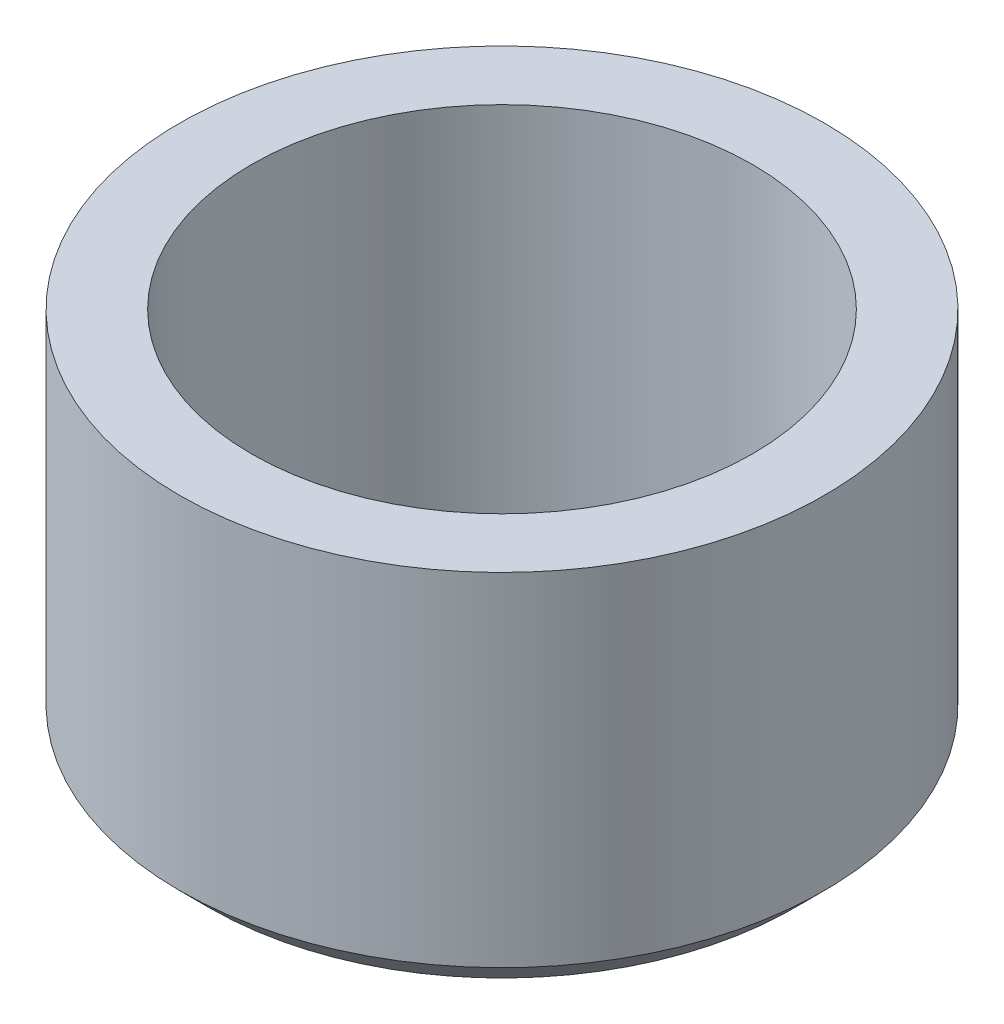
ISO-10303-21;
HEADER;
FILE_DESCRIPTION(('STEP AP214'),'2;1');
FILE_NAME('part.step','',(''),(''),'','','');
FILE_SCHEMA(('AUTOMOTIVE_DESIGN { 1 0 10303 214 1 1 1 1 }'));
ENDSEC;
DATA;
#1=APPLICATION_CONTEXT('core data for automotive mechanical design processes');
#2=APPLICATION_PROTOCOL_DEFINITION('international standard','automotive_design',2000,#1);
#3=PRODUCT_CONTEXT('',#1,'mechanical');
#4=PRODUCT('Part','Part','',(#3));
#5=PRODUCT_RELATED_PRODUCT_CATEGORY('part','',(#4));
#6=PRODUCT_DEFINITION_FORMATION('','',#4);
#7=PRODUCT_DEFINITION_CONTEXT('part definition',#1,'design');
#8=PRODUCT_DEFINITION('design','',#6,#7);
#9=PRODUCT_DEFINITION_SHAPE('','',#8);
#10=(LENGTH_UNIT() NAMED_UNIT(*) SI_UNIT(.MILLI.,.METRE.));
#11=(NAMED_UNIT(*) PLANE_ANGLE_UNIT() SI_UNIT($,.RADIAN.));
#12=(NAMED_UNIT(*) SI_UNIT($,.STERADIAN.) SOLID_ANGLE_UNIT());
#13=UNCERTAINTY_MEASURE_WITH_UNIT(LENGTH_MEASURE(1.E-05),#10,'distance_accuracy_value','');
#14=(GEOMETRIC_REPRESENTATION_CONTEXT(3) GLOBAL_UNCERTAINTY_ASSIGNED_CONTEXT((#13)) GLOBAL_UNIT_ASSIGNED_CONTEXT((#10,
#11,#12)) REPRESENTATION_CONTEXT('',''));
#15=CARTESIAN_POINT('',(0.,0.,0.));
#16=DIRECTION('',(0.,0.,1.));
#17=DIRECTION('',(1.,0.,0.));
#18=AXIS2_PLACEMENT_3D('',#15,#16,#17);
#19=CARTESIAN_POINT('',(-5.275,6.1,0.));
#20=DIRECTION('',(0.,1.,0.));
#21=DIRECTION('',(0.,0.,1.));
#22=AXIS2_PLACEMENT_3D('',#19,#20,#21);
#23=PLANE('',#22);
#24=CARTESIAN_POINT('',(0.,6.1,0.));
#25=DIRECTION('',(0.,1.,0.));
#26=DIRECTION('',(0.,0.,1.));
#27=AXIS2_PLACEMENT_3D('',#24,#25,#26);
#28=CIRCLE('',#27,5.275);
#29=CARTESIAN_POINT('',(0.,6.1,5.275));
#30=VERTEX_POINT('',#29);
#31=EDGE_CURVE('E55',#30,#30,#28,.T.);
#32=ORIENTED_EDGE('',*,*,#31,.T.);
#33=EDGE_LOOP('',(#32));
#34=FACE_BOUND('',#33,.T.);
#35=CARTESIAN_POINT('',(0.,6.1,0.));
#36=DIRECTION('',(0.,1.,0.));
#37=DIRECTION('',(0.,0.,1.));
#38=AXIS2_PLACEMENT_3D('',#35,#36,#37);
#39=CIRCLE('',#38,4.1);
#40=CARTESIAN_POINT('',(0.,6.1,4.1));
#41=VERTEX_POINT('',#40);
#42=EDGE_CURVE('E66',#41,#41,#39,.T.);
#43=ORIENTED_EDGE('',*,*,#42,.F.);
#44=EDGE_LOOP('',(#43));
#45=FACE_BOUND('',#44,.T.);
#46=ADVANCED_FACE('F41',(#34,#45),#23,.T.);
#47=CARTESIAN_POINT('',(0.,36.0573770491804,0.));
#48=DIRECTION('',(0.,1.,0.));
#49=DIRECTION('',(0.,0.,1.));
#50=AXIS2_PLACEMENT_3D('',#47,#48,#49);
#51=CYLINDRICAL_SURFACE('',#50,5.275);
#52=CARTESIAN_POINT('',(0.,0.5,0.));
#53=DIRECTION('',(0.,-1.,0.));
#54=DIRECTION('',(0.,0.,-1.));
#55=AXIS2_PLACEMENT_3D('',#52,#53,#54);
#56=CIRCLE('',#55,5.275);
#57=CARTESIAN_POINT('',(0.,0.5,-5.275));
#58=VERTEX_POINT('',#57);
#59=EDGE_CURVE('E49',#58,#58,#56,.F.);
#60=ORIENTED_EDGE('',*,*,#59,.T.);
#61=EDGE_LOOP('',(#60));
#62=FACE_BOUND('',#61,.T.);
#63=ORIENTED_EDGE('',*,*,#31,.F.);
#64=EDGE_LOOP('',(#63));
#65=FACE_BOUND('',#64,.T.);
#66=ADVANCED_FACE('F74',(#62,#65),#51,.T.);
#67=CARTESIAN_POINT('',(-5.275,0.,0.));
#68=DIRECTION('',(0.,-1.,0.));
#69=DIRECTION('',(0.,0.,-1.));
#70=AXIS2_PLACEMENT_3D('',#67,#68,#69);
#71=PLANE('',#70);
#72=CARTESIAN_POINT('',(0.,0.,0.));
#73=DIRECTION('',(0.,-1.,0.));
#74=DIRECTION('',(0.,0.,-1.));
#75=AXIS2_PLACEMENT_3D('',#72,#73,#74);
#76=CIRCLE('',#75,4.775);
#77=CARTESIAN_POINT('',(0.,0.,-4.775));
#78=VERTEX_POINT('',#77);
#79=EDGE_CURVE('E10',#78,#78,#76,.T.);
#80=ORIENTED_EDGE('',*,*,#79,.T.);
#81=EDGE_LOOP('',(#80));
#82=FACE_BOUND('',#81,.T.);
#83=CARTESIAN_POINT('',(0.,0.,0.));
#84=DIRECTION('',(0.,1.,0.));
#85=DIRECTION('',(0.,0.,1.));
#86=AXIS2_PLACEMENT_3D('',#83,#84,#85);
#87=CIRCLE('',#86,4.1);
#88=CARTESIAN_POINT('',(0.,0.,4.1));
#89=VERTEX_POINT('',#88);
#90=EDGE_CURVE('E61',#89,#89,#87,.T.);
#91=ORIENTED_EDGE('',*,*,#90,.T.);
#92=EDGE_LOOP('',(#91));
#93=FACE_BOUND('',#92,.T.);
#94=ADVANCED_FACE('F78',(#82,#93),#71,.T.);
#95=CARTESIAN_POINT('',(0.,36.0573770491804,0.));
#96=DIRECTION('',(0.,1.,0.));
#97=DIRECTION('',(0.,0.,1.));
#98=AXIS2_PLACEMENT_3D('',#95,#96,#97);
#99=CYLINDRICAL_SURFACE('',#98,4.1);
#100=ORIENTED_EDGE('',*,*,#42,.T.);
#101=EDGE_LOOP('',(#100));
#102=FACE_BOUND('',#101,.T.);
#103=ORIENTED_EDGE('',*,*,#90,.F.);
#104=EDGE_LOOP('',(#103));
#105=FACE_BOUND('',#104,.T.);
#106=ADVANCED_FACE('F70',(#102,#105),#99,.F.);
#107=CARTESIAN_POINT('',(0.,0.5,0.));
#108=DIRECTION('',(0.,1.,0.));
#109=DIRECTION('',(0.,0.,1.));
#110=AXIS2_PLACEMENT_3D('',#107,#108,#109);
#111=CONICAL_SURFACE('',#110,5.275,0.785398163397449);
#112=ORIENTED_EDGE('',*,*,#79,.F.);
#113=EDGE_LOOP('',(#112));
#114=FACE_BOUND('',#113,.T.);
#115=ORIENTED_EDGE('',*,*,#59,.F.);
#116=EDGE_LOOP('',(#115));
#117=FACE_BOUND('',#116,.T.);
#118=ADVANCED_FACE('F43',(#114,#117),#111,.T.);
#119=CLOSED_SHELL('',(#46,#66,#94,#106,#118));
#120=MANIFOLD_SOLID_BREP('B2',#119);
#121=ADVANCED_BREP_SHAPE_REPRESENTATION('',(#18,#120),#14);
#122=SHAPE_DEFINITION_REPRESENTATION(#9,#121);
ENDSEC;
END-ISO-10303-21;
